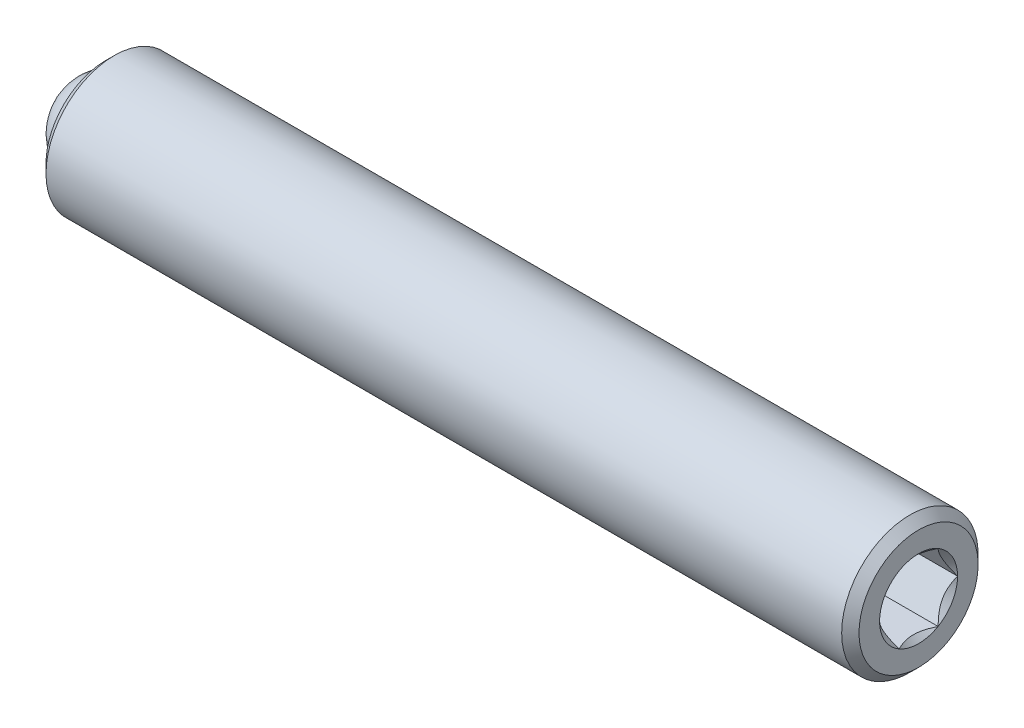
ISO-10303-21;
HEADER;
FILE_DESCRIPTION(('STEP AP214'),'2;1');
FILE_NAME('part.step','',(''),(''),'','','');
FILE_SCHEMA(('AUTOMOTIVE_DESIGN { 1 0 10303 214 1 1 1 1 }'));
ENDSEC;
DATA;
#1=APPLICATION_CONTEXT('core data for automotive mechanical design processes');
#2=APPLICATION_PROTOCOL_DEFINITION('international standard','automotive_design',2000,#1);
#3=PRODUCT_CONTEXT('',#1,'mechanical');
#4=PRODUCT('Part','Part','',(#3));
#5=PRODUCT_RELATED_PRODUCT_CATEGORY('part','',(#4));
#6=PRODUCT_DEFINITION_FORMATION('','',#4);
#7=PRODUCT_DEFINITION_CONTEXT('part definition',#1,'design');
#8=PRODUCT_DEFINITION('design','',#6,#7);
#9=PRODUCT_DEFINITION_SHAPE('','',#8);
#10=(LENGTH_UNIT() NAMED_UNIT(*) SI_UNIT(.MILLI.,.METRE.));
#11=(NAMED_UNIT(*) PLANE_ANGLE_UNIT() SI_UNIT($,.RADIAN.));
#12=(NAMED_UNIT(*) SI_UNIT($,.STERADIAN.) SOLID_ANGLE_UNIT());
#13=UNCERTAINTY_MEASURE_WITH_UNIT(LENGTH_MEASURE(1.E-05),#10,'distance_accuracy_value','');
#14=(GEOMETRIC_REPRESENTATION_CONTEXT(3) GLOBAL_UNCERTAINTY_ASSIGNED_CONTEXT((#13)) GLOBAL_UNIT_ASSIGNED_CONTEXT((#10,
#11,#12)) REPRESENTATION_CONTEXT('',''));
#15=CARTESIAN_POINT('',(0.,0.,0.));
#16=DIRECTION('',(0.,0.,1.));
#17=DIRECTION('',(1.,0.,0.));
#18=AXIS2_PLACEMENT_3D('',#15,#16,#17);
#19=CARTESIAN_POINT('',(-25.0609539380308,-2.1857766167841,19.3587570761906));
#20=DIRECTION('',(1.,0.,0.));
#21=DIRECTION('',(0.,0.,-1.));
#22=AXIS2_PLACEMENT_3D('',#19,#20,#21);
#23=PLANE('',#22);
#24=CARTESIAN_POINT('',(-25.0609539380308,-2.1857766167841,19.3587570761906));
#25=DIRECTION('',(1.,0.,0.));
#26=DIRECTION('',(0.,0.,-1.));
#27=AXIS2_PLACEMENT_3D('',#24,#25,#26);
#28=CIRCLE('',#27,0.99694999999999);
#29=CARTESIAN_POINT('',(-25.0609539380308,-1.5931847524018,18.5570437952928));
#30=VERTEX_POINT('',#29);
#31=CARTESIAN_POINT('',(-25.0609539380308,-1.1951766167841,19.2464141080085));
#32=VERTEX_POINT('',#31);
#33=EDGE_CURVE('P0_E11',#30,#32,#28,.T.);
#34=ORIENTED_EDGE('',*,*,#33,.F.);
#35=DIRECTION('',(0.,0.866025403784439,0.5));
#36=VECTOR('',#35,1.);
#37=CARTESIAN_POINT('',(-25.0609539380308,-2.1857766167841,18.2149107228721));
#38=LINE('',#37,#36);
#39=CARTESIAN_POINT('',(-25.0609539380308,-1.1951766167841,18.7868338995314));
#40=VERTEX_POINT('',#39);
#41=EDGE_CURVE('P0_E280',#30,#40,#38,.T.);
#42=ORIENTED_EDGE('',*,*,#41,.T.);
#43=DIRECTION('',(0.,0.,1.));
#44=VECTOR('',#43,1.);
#45=CARTESIAN_POINT('',(-25.0609539380308,-1.1951766167841,18.7868338995314));
#46=LINE('',#45,#44);
#47=EDGE_CURVE('P0_E233',#40,#32,#46,.T.);
#48=ORIENTED_EDGE('',*,*,#47,.T.);
#49=EDGE_LOOP('',(#34,#42,#48));
#50=FACE_BOUND('',#49,.T.);
#51=ADVANCED_FACE('P0_F17',(#50),#23,.T.);
#52=CARTESIAN_POINT('',(-25.0609539380308,-1.1951766167841,19.4711000443728));
#53=VERTEX_POINT('',#52);
#54=CARTESIAN_POINT('',(-25.0609539380308,-1.5931847524018,20.1604703570884));
#55=VERTEX_POINT('',#54);
#56=EDGE_CURVE('P0_E26',#53,#55,#28,.T.);
#57=ORIENTED_EDGE('',*,*,#56,.F.);
#58=CARTESIAN_POINT('',(-25.0609539380308,-1.1951766167841,19.9306802528499));
#59=VERTEX_POINT('',#58);
#60=EDGE_CURVE('P0_E275',#53,#59,#46,.T.);
#61=ORIENTED_EDGE('',*,*,#60,.T.);
#62=DIRECTION('',(0.,-0.866025403784439,0.5));
#63=VECTOR('',#62,1.);
#64=CARTESIAN_POINT('',(-25.0609539380308,-1.1951766167841,19.9306802528499));
#65=LINE('',#64,#63);
#66=EDGE_CURVE('P0_E296',#59,#55,#65,.T.);
#67=ORIENTED_EDGE('',*,*,#66,.T.);
#68=EDGE_LOOP('',(#57,#61,#67));
#69=FACE_BOUND('',#68,.T.);
#70=ADVANCED_FACE('P0_F332',(#69),#23,.T.);
#71=CARTESIAN_POINT('',(-25.0609539380308,-1.7877684811664,20.2728133252706));
#72=VERTEX_POINT('',#71);
#73=CARTESIAN_POINT('',(-25.0609539380308,-2.58378475240179,20.2728133252706));
#74=VERTEX_POINT('',#73);
#75=EDGE_CURVE('P0_E392',#72,#74,#28,.T.);
#76=ORIENTED_EDGE('',*,*,#75,.F.);
#77=CARTESIAN_POINT('',(-25.0609539380308,-2.1857766167841,20.5026034295091));
#78=VERTEX_POINT('',#77);
#79=EDGE_CURVE('P0_E250',#72,#78,#65,.T.);
#80=ORIENTED_EDGE('',*,*,#79,.T.);
#81=DIRECTION('',(0.,-0.866025403784439,-0.5));
#82=VECTOR('',#81,1.);
#83=CARTESIAN_POINT('',(-25.0609539380308,-2.1857766167841,20.5026034295091));
#84=LINE('',#83,#82);
#85=EDGE_CURVE('P0_E291',#78,#74,#84,.T.);
#86=ORIENTED_EDGE('',*,*,#85,.T.);
#87=EDGE_LOOP('',(#76,#80,#86));
#88=FACE_BOUND('',#87,.T.);
#89=ADVANCED_FACE('P0_F337',(#88),#23,.T.);
#90=CARTESIAN_POINT('',(-25.0609539380308,-2.7783684811664,20.1604703570884));
#91=VERTEX_POINT('',#90);
#92=CARTESIAN_POINT('',(-25.0609539380308,-3.1763766167841,19.4711000443728));
#93=VERTEX_POINT('',#92);
#94=EDGE_CURVE('P0_E369',#91,#93,#28,.T.);
#95=ORIENTED_EDGE('',*,*,#94,.F.);
#96=CARTESIAN_POINT('',(-25.0609539380308,-3.1763766167841,19.9306802528499));
#97=VERTEX_POINT('',#96);
#98=EDGE_CURVE('P0_E295',#91,#97,#84,.T.);
#99=ORIENTED_EDGE('',*,*,#98,.T.);
#100=DIRECTION('',(0.,0.,-1.));
#101=VECTOR('',#100,1.);
#102=CARTESIAN_POINT('',(-25.0609539380308,-3.1763766167841,19.9306802528499));
#103=LINE('',#102,#101);
#104=EDGE_CURVE('P0_E286',#97,#93,#103,.T.);
#105=ORIENTED_EDGE('',*,*,#104,.T.);
#106=EDGE_LOOP('',(#95,#99,#105));
#107=FACE_BOUND('',#106,.T.);
#108=ADVANCED_FACE('P0_F352',(#107),#23,.T.);
#109=CARTESIAN_POINT('',(-25.0609539380308,-3.1763766167841,19.2464141080084));
#110=VERTEX_POINT('',#109);
#111=CARTESIAN_POINT('',(-25.0609539380308,-2.7783684811664,18.5570437952928));
#112=VERTEX_POINT('',#111);
#113=EDGE_CURVE('P0_E363',#110,#112,#28,.T.);
#114=ORIENTED_EDGE('',*,*,#113,.F.);
#115=CARTESIAN_POINT('',(-25.0609539380308,-3.1763766167841,18.7868338995314));
#116=VERTEX_POINT('',#115);
#117=EDGE_CURVE('P0_E290',#110,#116,#103,.T.);
#118=ORIENTED_EDGE('',*,*,#117,.T.);
#119=DIRECTION('',(0.,0.866025403784439,-0.5));
#120=VECTOR('',#119,1.);
#121=CARTESIAN_POINT('',(-25.0609539380308,-3.1763766167841,18.7868338995314));
#122=LINE('',#121,#120);
#123=EDGE_CURVE('P0_E281',#116,#112,#122,.T.);
#124=ORIENTED_EDGE('',*,*,#123,.T.);
#125=EDGE_LOOP('',(#114,#118,#124));
#126=FACE_BOUND('',#125,.T.);
#127=ADVANCED_FACE('P0_F343',(#126),#23,.T.);
#128=CARTESIAN_POINT('',(-45.8445539380308,-0.788776616784098,19.3587570761906));
#129=DIRECTION('',(1.,0.,0.));
#130=DIRECTION('',(0.,0.,-1.));
#131=AXIS2_PLACEMENT_3D('',#128,#129,#130);
#132=PLANE('',#131);
#133=CARTESIAN_POINT('',(-45.8445539380308,-2.1857766167841,19.3587570761906));
#134=DIRECTION('',(1.,0.,0.));
#135=DIRECTION('',(0.,0.,-1.));
#136=AXIS2_PLACEMENT_3D('',#133,#134,#135);
#137=CIRCLE('',#136,1.74599999999999);
#138=CARTESIAN_POINT('',(-45.8445539380308,-2.1857766167841,17.6127570761906));
#139=VERTEX_POINT('',#138);
#140=EDGE_CURVE('P0_E210',#139,#139,#137,.F.);
#141=ORIENTED_EDGE('',*,*,#140,.T.);
#142=EDGE_LOOP('',(#141));
#143=FACE_BOUND('',#142,.T.);
#144=CARTESIAN_POINT('',(-45.8445539380308,-2.1857766167841,19.3587570761906));
#145=DIRECTION('',(-1.,0.,0.));
#146=DIRECTION('',(0.,0.,1.));
#147=AXIS2_PLACEMENT_3D('',#144,#145,#146);
#148=CIRCLE('',#147,1.397);
#149=CARTESIAN_POINT('',(-45.8445539380308,-2.1857766167841,20.7557570761906));
#150=VERTEX_POINT('',#149);
#151=EDGE_CURVE('P0_E222',#150,#150,#148,.T.);
#152=ORIENTED_EDGE('',*,*,#151,.F.);
#153=EDGE_LOOP('',(#152));
#154=FACE_BOUND('',#153,.T.);
#155=ADVANCED_FACE('P0_F351',(#143,#154),#132,.F.);
#156=CARTESIAN_POINT('',(-43.659460411547,-2.1857766167841,19.3587570761906));
#157=DIRECTION('',(-1.,0.,0.));
#158=DIRECTION('',(0.,0.,1.));
#159=AXIS2_PLACEMENT_3D('',#156,#157,#158);
#160=CYLINDRICAL_SURFACE('',#159,1.397);
#161=CARTESIAN_POINT('',(-45.056460411547,-2.1857766167841,19.3587570761906));
#162=DIRECTION('',(-1.,0.,0.));
#163=DIRECTION('',(0.,0.,1.));
#164=AXIS2_PLACEMENT_3D('',#161,#162,#163);
#165=CIRCLE('',#164,1.397);
#166=CARTESIAN_POINT('',(-45.056460411547,-2.1857766167841,20.7557570761906));
#167=VERTEX_POINT('',#166);
#168=EDGE_CURVE('P0_E225',#167,#167,#165,.T.);
#169=ORIENTED_EDGE('',*,*,#168,.F.);
#170=EDGE_LOOP('',(#169));
#171=FACE_BOUND('',#170,.T.);
#172=ORIENTED_EDGE('',*,*,#151,.T.);
#173=EDGE_LOOP('',(#172));
#174=FACE_BOUND('',#173,.T.);
#175=ADVANCED_FACE('P0_F358',(#171,#174),#160,.F.);
#176=CARTESIAN_POINT('',(-45.056460411547,-2.1857766167841,19.3587570761906));
#177=DIRECTION('',(-1.,0.,0.));
#178=DIRECTION('',(0.,0.,1.));
#179=AXIS2_PLACEMENT_3D('',#176,#177,#178);
#180=CONICAL_SURFACE('',#179,1.397,0.785398163397451);
#181=CARTESIAN_POINT('',(-43.659460411547,-2.1857766167841,19.3587570761906));
#182=VERTEX_POINT('',#181);
#183=VERTEX_LOOP('',#182);
#184=FACE_BOUND('',#183,.T.);
#185=ORIENTED_EDGE('',*,*,#168,.T.);
#186=EDGE_LOOP('',(#185));
#187=FACE_BOUND('',#186,.T.);
#188=ADVANCED_FACE('P0_F591',(#184,#187),#180,.F.);
#189=CARTESIAN_POINT('',(-22.0129539380308,-2.1857766167841,19.3587570761906));
#190=DIRECTION('',(-1.,0.,0.));
#191=DIRECTION('',(0.,0.,1.));
#192=AXIS2_PLACEMENT_3D('',#189,#190,#191);
#193=PLANE('',#192);
#194=DIRECTION('',(0.,-0.866025403784439,0.5));
#195=VECTOR('',#194,1.);
#196=CARTESIAN_POINT('',(-22.0129539380308,-1.1951766167841,19.9306802528499));
#197=LINE('',#196,#195);
#198=CARTESIAN_POINT('',(-22.0129539380308,-2.18431068983532,20.5017570761906));
#199=VERTEX_POINT('',#198);
#200=CARTESIAN_POINT('',(-22.0129539380308,-2.1857766167841,20.5026034295091));
#201=VERTEX_POINT('',#200);
#202=EDGE_CURVE('P0_E271',#199,#201,#197,.T.);
#203=ORIENTED_EDGE('',*,*,#202,.F.);
#204=CARTESIAN_POINT('',(-22.0129539380308,-2.1857766167841,19.3587570761906));
#205=DIRECTION('',(1.,0.,0.));
#206=DIRECTION('',(0.,1.,0.));
#207=AXIS2_PLACEMENT_3D('',#204,#205,#206);
#208=CIRCLE('',#207,1.143);
#209=CARTESIAN_POINT('',(-22.0129539380308,-1.19664417556542,19.9315275483073));
#210=VERTEX_POINT('',#209);
#211=EDGE_CURVE('P0_E40',#210,#199,#208,.T.);
#212=ORIENTED_EDGE('',*,*,#211,.F.);
#213=CARTESIAN_POINT('',(-22.0129539380308,-1.1951766167841,19.9306802528499));
#214=VERTEX_POINT('',#213);
#215=EDGE_CURVE('P0_E268',#214,#210,#197,.T.);
#216=ORIENTED_EDGE('',*,*,#215,.F.);
#217=DIRECTION('',(0.,0.,1.));
#218=VECTOR('',#217,1.);
#219=CARTESIAN_POINT('',(-22.0129539380308,-1.1951766167841,18.7868338995314));
#220=LINE('',#219,#218);
#221=CARTESIAN_POINT('',(-22.0129539380308,-1.1951766167841,19.928985661935));
#222=VERTEX_POINT('',#221);
#223=EDGE_CURVE('P0_E251',#222,#214,#220,.T.);
#224=ORIENTED_EDGE('',*,*,#223,.F.);
#225=CARTESIAN_POINT('',(-22.0129539380308,-1.1951766167841,18.7885284904463));
#226=VERTEX_POINT('',#225);
#227=EDGE_CURVE('P0_E157',#226,#222,#208,.T.);
#228=ORIENTED_EDGE('',*,*,#227,.F.);
#229=CARTESIAN_POINT('',(-22.0129539380308,-1.1951766167841,18.7868338995314));
#230=VERTEX_POINT('',#229);
#231=EDGE_CURVE('P0_E247',#230,#226,#220,.T.);
#232=ORIENTED_EDGE('',*,*,#231,.F.);
#233=DIRECTION('',(0.,0.866025403784439,0.5));
#234=VECTOR('',#233,1.);
#235=CARTESIAN_POINT('',(-22.0129539380308,-2.1857766167841,18.2149107228721));
#236=LINE('',#235,#234);
#237=CARTESIAN_POINT('',(-22.0129539380308,-1.19664417556542,18.7859866040739));
#238=VERTEX_POINT('',#237);
#239=EDGE_CURVE('P0_E255',#238,#230,#236,.T.);
#240=ORIENTED_EDGE('',*,*,#239,.F.);
#241=CARTESIAN_POINT('',(-22.0129539380308,-2.18430905800278,18.2157580183296));
#242=VERTEX_POINT('',#241);
#243=EDGE_CURVE('P0_E160',#242,#238,#208,.T.);
#244=ORIENTED_EDGE('',*,*,#243,.F.);
#245=CARTESIAN_POINT('',(-22.0129539380308,-2.1857766167841,18.2149107228721));
#246=VERTEX_POINT('',#245);
#247=EDGE_CURVE('P0_E252',#246,#242,#236,.T.);
#248=ORIENTED_EDGE('',*,*,#247,.F.);
#249=DIRECTION('',(0.,0.866025403784439,-0.5));
#250=VECTOR('',#249,1.);
#251=CARTESIAN_POINT('',(-22.0129539380308,-3.1763766167841,18.7868338995314));
#252=LINE('',#251,#250);
#253=CARTESIAN_POINT('',(-22.0129539380308,-2.18724254373287,18.2157570761906));
#254=VERTEX_POINT('',#253);
#255=EDGE_CURVE('P0_E259',#254,#246,#252,.T.);
#256=ORIENTED_EDGE('',*,*,#255,.F.);
#257=CARTESIAN_POINT('',(-22.0129539380308,-3.17490905800278,18.7859866040739));
#258=VERTEX_POINT('',#257);
#259=EDGE_CURVE('P0_E433',#258,#254,#208,.T.);
#260=ORIENTED_EDGE('',*,*,#259,.F.);
#261=CARTESIAN_POINT('',(-22.0129539380308,-3.1763766167841,18.7868338995314));
#262=VERTEX_POINT('',#261);
#263=EDGE_CURVE('P0_E256',#262,#258,#252,.T.);
#264=ORIENTED_EDGE('',*,*,#263,.F.);
#265=DIRECTION('',(0.,0.,-1.));
#266=VECTOR('',#265,1.);
#267=CARTESIAN_POINT('',(-22.0129539380308,-3.1763766167841,19.9306802528499));
#268=LINE('',#267,#266);
#269=CARTESIAN_POINT('',(-22.0129539380308,-3.1763766167841,18.7885284904463));
#270=VERTEX_POINT('',#269);
#271=EDGE_CURVE('P0_E263',#270,#262,#268,.T.);
#272=ORIENTED_EDGE('',*,*,#271,.F.);
#273=CARTESIAN_POINT('',(-22.0129539380308,-3.1763766167841,19.928985661935));
#274=VERTEX_POINT('',#273);
#275=EDGE_CURVE('P0_E429',#274,#270,#208,.T.);
#276=ORIENTED_EDGE('',*,*,#275,.F.);
#277=CARTESIAN_POINT('',(-22.0129539380308,-3.1763766167841,19.9306802528499));
#278=VERTEX_POINT('',#277);
#279=EDGE_CURVE('P0_E260',#278,#274,#268,.T.);
#280=ORIENTED_EDGE('',*,*,#279,.F.);
#281=DIRECTION('',(0.,-0.866025403784439,-0.5));
#282=VECTOR('',#281,1.);
#283=CARTESIAN_POINT('',(-22.0129539380308,-2.1857766167841,20.5026034295091));
#284=LINE('',#283,#282);
#285=CARTESIAN_POINT('',(-22.0129539380308,-3.17490905800278,19.9315275483073));
#286=VERTEX_POINT('',#285);
#287=EDGE_CURVE('P0_E267',#286,#278,#284,.T.);
#288=ORIENTED_EDGE('',*,*,#287,.F.);
#289=CARTESIAN_POINT('',(-22.0129539380308,-2.18724417556542,20.5017561340517));
#290=VERTEX_POINT('',#289);
#291=EDGE_CURVE('P0_E432',#290,#286,#208,.T.);
#292=ORIENTED_EDGE('',*,*,#291,.F.);
#293=EDGE_CURVE('P0_E264',#201,#290,#284,.T.);
#294=ORIENTED_EDGE('',*,*,#293,.F.);
#295=EDGE_LOOP('',(#203,#212,#216,#224,#228,#232,#240,#244,#248,#256,#260,#264,#272,#276,#280,
#288,#292,#294));
#296=FACE_BOUND('',#295,.T.);
#297=CARTESIAN_POINT('',(-22.0129539380308,-2.1857766167841,19.3587570761906));
#298=DIRECTION('',(-1.,0.,0.));
#299=DIRECTION('',(0.,0.,1.));
#300=AXIS2_PLACEMENT_3D('',#297,#298,#299);
#301=CIRCLE('',#300,1.74599999999999);
#302=CARTESIAN_POINT('',(-22.0129539380308,-2.1857766167841,21.1047570761906));
#303=VERTEX_POINT('',#302);
#304=EDGE_CURVE('P0_E213',#303,#303,#301,.F.);
#305=ORIENTED_EDGE('',*,*,#304,.T.);
#306=EDGE_LOOP('',(#305));
#307=FACE_BOUND('',#306,.T.);
#308=ADVANCED_FACE('P0_F425',(#296,#307),#193,.F.);
#309=CARTESIAN_POINT('',(-43.659460411547,-2.1857766167841,19.3587570761906));
#310=DIRECTION('',(-1.,0.,0.));
#311=DIRECTION('',(0.,0.,1.));
#312=AXIS2_PLACEMENT_3D('',#309,#310,#311);
#313=CYLINDRICAL_SURFACE('',#312,2.);
#314=CARTESIAN_POINT('',(-22.2669539380308,-2.1857766167841,19.3587570761906));
#315=DIRECTION('',(-1.,0.,0.));
#316=DIRECTION('',(0.,0.,1.));
#317=AXIS2_PLACEMENT_3D('',#314,#315,#316);
#318=CIRCLE('',#317,2.);
#319=CARTESIAN_POINT('',(-22.2669539380308,-2.1857766167841,21.3587570761906));
#320=VERTEX_POINT('',#319);
#321=EDGE_CURVE('P0_E216',#320,#320,#318,.T.);
#322=ORIENTED_EDGE('',*,*,#321,.T.);
#323=EDGE_LOOP('',(#322));
#324=FACE_BOUND('',#323,.T.);
#325=CARTESIAN_POINT('',(-45.5905539380308,-2.1857766167841,19.3587570761906));
#326=DIRECTION('',(1.,0.,0.));
#327=DIRECTION('',(0.,0.,-1.));
#328=AXIS2_PLACEMENT_3D('',#325,#326,#327);
#329=CIRCLE('',#328,2.);
#330=CARTESIAN_POINT('',(-45.5905539380308,-2.1857766167841,17.3587570761906));
#331=VERTEX_POINT('',#330);
#332=EDGE_CURVE('P0_E219',#331,#331,#329,.T.);
#333=ORIENTED_EDGE('',*,*,#332,.T.);
#334=EDGE_LOOP('',(#333));
#335=FACE_BOUND('',#334,.T.);
#336=ADVANCED_FACE('P0_F572',(#324,#335),#313,.T.);
#337=CARTESIAN_POINT('',(-22.2669539380308,-2.1857766167841,19.3587570761906));
#338=DIRECTION('',(-1.,0.,0.));
#339=DIRECTION('',(0.,0.,1.));
#340=AXIS2_PLACEMENT_3D('',#337,#338,#339);
#341=CONICAL_SURFACE('',#340,2.,0.785398163397453);
#342=ORIENTED_EDGE('',*,*,#304,.F.);
#343=EDGE_LOOP('',(#342));
#344=FACE_BOUND('',#343,.T.);
#345=ORIENTED_EDGE('',*,*,#321,.F.);
#346=EDGE_LOOP('',(#345));
#347=FACE_BOUND('',#346,.T.);
#348=ADVANCED_FACE('P0_F563',(#344,#347),#341,.T.);
#349=CARTESIAN_POINT('',(-45.8445539380308,-2.1857766167841,19.3587570761906));
#350=DIRECTION('',(1.,0.,0.));
#351=DIRECTION('',(0.,0.,-1.));
#352=AXIS2_PLACEMENT_3D('',#349,#350,#351);
#353=CONICAL_SURFACE('',#352,1.74599999999999,0.785398163397447);
#354=ORIENTED_EDGE('',*,*,#332,.F.);
#355=EDGE_LOOP('',(#354));
#356=FACE_BOUND('',#355,.T.);
#357=ORIENTED_EDGE('',*,*,#140,.F.);
#358=EDGE_LOOP('',(#357));
#359=FACE_BOUND('',#358,.T.);
#360=ADVANCED_FACE('P0_F19',(#356,#359),#353,.T.);
#361=CARTESIAN_POINT('',(-25.0609539380308,-1.1951766167841,19.9306802528499));
#362=DIRECTION('',(0.,0.5,0.866025403784439));
#363=DIRECTION('',(0.,-0.866025403784439,0.5));
#364=AXIS2_PLACEMENT_3D('',#361,#362,#363);
#365=PLANE('',#364);
#366=ORIENTED_EDGE('',*,*,#215,.T.);
#367=CARTESIAN_POINT('',(-22.0127539380306,-1.19629708462967,19.9313271552621));
#368=CARTESIAN_POINT('',(-22.0323203966513,-1.23027713683179,19.9509455475481));
#369=CARTESIAN_POINT('',(-22.050734551924,-1.26482458320621,19.9708915250122));
#370=CARTESIAN_POINT('',(-22.0844446571083,-1.33526642538763,20.0115611415578));
#371=CARTESIAN_POINT('',(-22.099721950327,-1.37116745758587,20.0322886121617));
#372=CARTESIAN_POINT('',(-22.1258887915356,-1.44355953242849,20.0740841960592));
#373=CARTESIAN_POINT('',(-22.1368438216406,-1.48003230401243,20.0951417605513));
#374=CARTESIAN_POINT('',(-22.1537198985939,-1.55377672378025,20.1377181211555));
#375=CARTESIAN_POINT('',(-22.1596534608479,-1.59104614703134,20.1592356327021));
#376=CARTESIAN_POINT('',(-22.165007326587,-1.65534085443795,20.1963561993307));
#377=CARTESIAN_POINT('',(-22.1657947467285,-1.68228352692575,20.2119115585443));
#378=CARTESIAN_POINT('',(-22.1644413410196,-1.73611604660882,20.2429917782744));
#379=CARTESIAN_POINT('',(-22.1622998637595,-1.76300588072026,20.2585166312371));
#380=CARTESIAN_POINT('',(-22.1516239297961,-1.84329004327281,20.3048687140985));
#381=CARTESIAN_POINT('',(-22.1388368167575,-1.89628409647321,20.3354648449792));
#382=CARTESIAN_POINT('',(-22.1080756453399,-1.98903319238966,20.3890135604737));
#383=CARTESIAN_POINT('',(-22.0917517057209,-2.02923399266128,20.4122235033321));
#384=CARTESIAN_POINT('',(-22.0549984488649,-2.10806972391492,20.4577393339932));
#385=CARTESIAN_POINT('',(-22.0345825312321,-2.14670928360318,20.4800478941806));
#386=CARTESIAN_POINT('',(-22.0127539380308,-2.18465614893815,20.5019565270966));
#387=B_SPLINE_CURVE_WITH_KNOTS('',3,(#367,#368,#369,#370,#371,#372,#373,#374,#375,#376,#377,
#378,#379,#380,#381,#382,#383,#384,#385,#386),.UNSPECIFIED.,.F.,.F.,(4,2,2,2,2,2,2,2,2,4),(0.,
0.1316251276196,0.264011770716206,0.394307736662359,0.524277991049733,0.617504646941291,
0.710752040542361,0.897297861024574,1.04472299547961,1.19167303462289),.UNSPECIFIED.);
#388=EDGE_CURVE('P0_E300',#210,#199,#387,.T.);
#389=ORIENTED_EDGE('',*,*,#388,.T.);
#390=ORIENTED_EDGE('',*,*,#202,.T.);
#391=DIRECTION('',(1.,0.,0.));
#392=VECTOR('',#391,1.);
#393=CARTESIAN_POINT('',(-25.0609539380308,-2.1857766167841,20.5026034295091));
#394=LINE('',#393,#392);
#395=EDGE_CURVE('P0_E229',#78,#201,#394,.T.);
#396=ORIENTED_EDGE('',*,*,#395,.F.);
#397=ORIENTED_EDGE('',*,*,#79,.F.);
#398=EDGE_CURVE('P0_E299',#55,#72,#65,.T.);
#399=ORIENTED_EDGE('',*,*,#398,.F.);
#400=ORIENTED_EDGE('',*,*,#66,.F.);
#401=DIRECTION('',(1.,0.,0.));
#402=VECTOR('',#401,1.);
#403=CARTESIAN_POINT('',(-25.0609539380308,-1.1951766167841,19.9306802528499));
#404=LINE('',#403,#402);
#405=EDGE_CURVE('P0_E228',#59,#214,#404,.T.);
#406=ORIENTED_EDGE('',*,*,#405,.T.);
#407=EDGE_LOOP('',(#366,#389,#390,#396,#397,#399,#400,#406));
#408=FACE_BOUND('',#407,.T.);
#409=ADVANCED_FACE('P0_F200',(#408),#365,.F.);
#410=CARTESIAN_POINT('',(-25.0609539380308,-1.1951766167841,18.7868338995314));
#411=DIRECTION('',(0.,1.,0.));
#412=DIRECTION('',(0.,0.,1.));
#413=AXIS2_PLACEMENT_3D('',#410,#411,#412);
#414=PLANE('',#413);
#415=ORIENTED_EDGE('',*,*,#231,.T.);
#416=CARTESIAN_POINT('',(-21.6456437212551,-1.1951766167841,18.2186919066072));
#417=CARTESIAN_POINT('',(-21.6665971803185,-1.1951766167841,18.2464543932723));
#418=CARTESIAN_POINT('',(-21.6873450172186,-1.1951766167841,18.2743716351102));
#419=CARTESIAN_POINT('',(-21.7283445269502,-1.1951766167841,18.3305783910264));
#420=CARTESIAN_POINT('',(-21.7485960747308,-1.1951766167841,18.358867996225));
#421=CARTESIAN_POINT('',(-21.8087678776801,-1.1951766167841,18.4448036925445));
#422=CARTESIAN_POINT('',(-21.8477825630218,-1.1951766167841,18.503094552172));
#423=CARTESIAN_POINT('',(-21.9243677119673,-1.1951766167841,18.6253244547819));
#424=CARTESIAN_POINT('',(-21.9617290347737,-1.1951766167841,18.6893960468096));
#425=CARTESIAN_POINT('',(-22.0300671318701,-1.1951766167841,18.8207387265946));
#426=CARTESIAN_POINT('',(-22.0610654287238,-1.1951766167841,18.8879980487983));
#427=CARTESIAN_POINT('',(-22.0989887951195,-1.1951766167841,18.988960474439));
#428=CARTESIAN_POINT('',(-22.1098740484261,-1.1951766167841,19.0211700554222));
#429=CARTESIAN_POINT('',(-22.1290585889083,-1.1951766167841,19.0863663095114));
#430=CARTESIAN_POINT('',(-22.137357697771,-1.1951766167841,19.1193530360324));
#431=CARTESIAN_POINT('',(-22.1507997441353,-1.1951766167841,19.1853502866765));
#432=CARTESIAN_POINT('',(-22.1559971777705,-1.1951766167841,19.2183495355872));
#433=CARTESIAN_POINT('',(-22.1631378151264,-1.1951766167841,19.2847110702303));
#434=CARTESIAN_POINT('',(-22.165080521211,-1.1951766167841,19.3180734106935));
#435=CARTESIAN_POINT('',(-22.1655645205581,-1.1951766167841,19.3836166067033));
#436=CARTESIAN_POINT('',(-22.1642261276975,-1.1951766167841,19.4157966151519));
#437=CARTESIAN_POINT('',(-22.1584880077532,-1.1951766167841,19.4798699930781));
#438=CARTESIAN_POINT('',(-22.1540889840993,-1.1951766167841,19.5117634267139));
#439=CARTESIAN_POINT('',(-22.1423950597889,-1.1951766167841,19.5755886979688));
#440=CARTESIAN_POINT('',(-22.1350504427217,-1.1951766167841,19.6075112879808));
#441=CARTESIAN_POINT('',(-22.1178555417028,-1.1951766167841,19.6706590428319));
#442=CARTESIAN_POINT('',(-22.1080054681313,-1.1951766167841,19.7018842659889));
#443=CARTESIAN_POINT('',(-22.0732804419676,-1.1951766167841,19.8002201044918));
#444=CARTESIAN_POINT('',(-22.0444496083024,-1.1951766167841,19.8659303847116));
#445=CARTESIAN_POINT('',(-21.9803485297404,-1.1951766167841,19.9942637799689));
#446=CARTESIAN_POINT('',(-21.9450551445965,-1.1951766167841,20.0568747396915));
#447=CARTESIAN_POINT('',(-21.872242612124,-1.1951766167841,20.1765329069357));
#448=CARTESIAN_POINT('',(-21.8349212556563,-1.1951766167841,20.2337019790826));
#449=CARTESIAN_POINT('',(-21.7772266519361,-1.1951766167841,20.3179291144673));
#450=CARTESIAN_POINT('',(-21.7577917564146,-1.1951766167841,20.3456412976581));
#451=CARTESIAN_POINT('',(-21.7184080438067,-1.1951766167841,20.4006870041668));
#452=CARTESIAN_POINT('',(-21.6984593687092,-1.1951766167841,20.4280206289596));
#453=CARTESIAN_POINT('',(-21.678297665075,-1.1951766167841,20.4551966326669));
#454=B_SPLINE_CURVE_WITH_KNOTS('',3,(#416,#417,#418,#419,#420,#421,#422,#423,#424,#425,#426,
#427,#428,#429,#430,#431,#432,#433,#434,#435,#436,#437,#438,#439,#440,#441,#442,#443,#444,#445,
#446,#447,#448,#449,#450,#451,#452,#453),.UNSPECIFIED.,.F.,.F.,(4,2,2,2,2,2,2,2,2,2,2,2,2,2,2,2,
2,2,4),(0.,0.104344019556665,0.208714065995308,0.41904723860194,0.641371595426507,
0.862931089855693,0.964842435960918,1.06676080722522,1.16683130424734,1.26691710029625,
1.36338812254199,1.45983698002154,1.55798726512869,1.65612931138883,1.87076833826788,
2.08619150382141,2.29090841446405,2.39244822901591,2.49396027677513),.UNSPECIFIED.);
#455=EDGE_CURVE('P0_E306',#226,#222,#454,.T.);
#456=ORIENTED_EDGE('',*,*,#455,.T.);
#457=ORIENTED_EDGE('',*,*,#223,.T.);
#458=ORIENTED_EDGE('',*,*,#405,.F.);
#459=ORIENTED_EDGE('',*,*,#60,.F.);
#460=EDGE_CURVE('P0_E274',#32,#53,#46,.T.);
#461=ORIENTED_EDGE('',*,*,#460,.F.);
#462=ORIENTED_EDGE('',*,*,#47,.F.);
#463=DIRECTION('',(1.,0.,0.));
#464=VECTOR('',#463,1.);
#465=CARTESIAN_POINT('',(-25.0609539380308,-1.1951766167841,18.7868338995314));
#466=LINE('',#465,#464);
#467=EDGE_CURVE('P0_E242',#40,#230,#466,.T.);
#468=ORIENTED_EDGE('',*,*,#467,.T.);
#469=EDGE_LOOP('',(#415,#456,#457,#458,#459,#461,#462,#468));
#470=FACE_BOUND('',#469,.T.);
#471=ADVANCED_FACE('P0_F318',(#470),#414,.F.);
#472=CARTESIAN_POINT('',(-25.0609539380308,-2.1857766167841,18.2149107228721));
#473=DIRECTION('',(0.,0.5,-0.866025403784439));
#474=DIRECTION('',(0.,0.866025403784439,0.5));
#475=AXIS2_PLACEMENT_3D('',#472,#473,#474);
#476=PLANE('',#475);
#477=ORIENTED_EDGE('',*,*,#247,.T.);
#478=CARTESIAN_POINT('',(-22.0127539380308,-2.18465614893816,18.2155576252846));
#479=CARTESIAN_POINT('',(-22.0323203966515,-2.15067609673606,18.2351760175706));
#480=CARTESIAN_POINT('',(-22.0507345519242,-2.11612865036166,18.2551219950346));
#481=CARTESIAN_POINT('',(-22.0844446571085,-2.04568680818029,18.2957916115803));
#482=CARTESIAN_POINT('',(-22.0997219503271,-2.00978577598207,18.3165190821841));
#483=CARTESIAN_POINT('',(-22.1258887915356,-1.93739370113951,18.3583146660816));
#484=CARTESIAN_POINT('',(-22.1368438216406,-1.90092092955559,18.3793722305737));
#485=CARTESIAN_POINT('',(-22.153719898594,-1.82717650978782,18.4219485911779));
#486=CARTESIAN_POINT('',(-22.1596534608479,-1.78990708653676,18.4434661027244));
#487=CARTESIAN_POINT('',(-22.165007326587,-1.72561237913018,18.4805866693531));
#488=CARTESIAN_POINT('',(-22.1657947467285,-1.69866970664238,18.4961420285666));
#489=CARTESIAN_POINT('',(-22.1644413410196,-1.64483718695932,18.5272222482967));
#490=CARTESIAN_POINT('',(-22.1622998637595,-1.61794735284788,18.5427471012595));
#491=CARTESIAN_POINT('',(-22.1516239297961,-1.53766319029533,18.5890991841208));
#492=CARTESIAN_POINT('',(-22.1388368167575,-1.48466913709493,18.6196953150015));
#493=CARTESIAN_POINT('',(-22.1080756453399,-1.39192004117843,18.673244030496));
#494=CARTESIAN_POINT('',(-22.0917517057209,-1.35171924090675,18.6964539733545));
#495=CARTESIAN_POINT('',(-22.0549984488648,-1.27288350965301,18.7419698040156));
#496=CARTESIAN_POINT('',(-22.034582531232,-1.23424394996469,18.764278364203));
#497=CARTESIAN_POINT('',(-22.0127539380306,-1.19629708462967,18.7861869971191));
#498=B_SPLINE_CURVE_WITH_KNOTS('',3,(#478,#479,#480,#481,#482,#483,#484,#485,#486,#487,#488,
#489,#490,#491,#492,#493,#494,#495,#496,#497),.UNSPECIFIED.,.F.,.F.,(4,2,2,2,2,2,2,2,2,4),(0.,
0.131625127619501,0.264011770716004,0.394307736662059,0.524277991049336,0.617504646940887,
0.710752040541952,0.89729786102416,1.04472299547941,1.19167303462289),.UNSPECIFIED.);
#499=EDGE_CURVE('P0_E313',#242,#238,#498,.T.);
#500=ORIENTED_EDGE('',*,*,#499,.T.);
#501=ORIENTED_EDGE('',*,*,#239,.T.);
#502=ORIENTED_EDGE('',*,*,#467,.F.);
#503=ORIENTED_EDGE('',*,*,#41,.F.);
#504=CARTESIAN_POINT('',(-25.0609539380308,-1.7877684811664,18.4447008271107));
#505=VERTEX_POINT('',#504);
#506=EDGE_CURVE('P0_E279',#505,#30,#38,.T.);
#507=ORIENTED_EDGE('',*,*,#506,.F.);
#508=CARTESIAN_POINT('',(-25.0609539380308,-2.1857766167841,18.2149107228721));
#509=VERTEX_POINT('',#508);
#510=EDGE_CURVE('P0_E276',#509,#505,#38,.T.);
#511=ORIENTED_EDGE('',*,*,#510,.F.);
#512=DIRECTION('',(1.,0.,0.));
#513=VECTOR('',#512,1.);
#514=CARTESIAN_POINT('',(-25.0609539380308,-2.1857766167841,18.2149107228721));
#515=LINE('',#514,#513);
#516=EDGE_CURVE('P0_E239',#509,#246,#515,.T.);
#517=ORIENTED_EDGE('',*,*,#516,.T.);
#518=EDGE_LOOP('',(#477,#500,#501,#502,#503,#507,#511,#517));
#519=FACE_BOUND('',#518,.T.);
#520=ADVANCED_FACE('P0_F321',(#519),#476,.F.);
#521=CARTESIAN_POINT('',(-25.0609539380308,-3.1763766167841,18.7868338995314));
#522=DIRECTION('',(0.,-0.5,-0.866025403784439));
#523=DIRECTION('',(0.,0.866025403784439,-0.5));
#524=AXIS2_PLACEMENT_3D('',#521,#522,#523);
#525=PLANE('',#524);
#526=ORIENTED_EDGE('',*,*,#263,.T.);
#527=CARTESIAN_POINT('',(-22.0127539380306,-3.17525614893852,18.7861869971191));
#528=CARTESIAN_POINT('',(-22.0323203966513,-3.14127609673641,18.7665686048331));
#529=CARTESIAN_POINT('',(-22.050734551924,-3.10672865036199,18.7466226273691));
#530=CARTESIAN_POINT('',(-22.0844446571083,-3.03628680818057,18.7059530108234));
#531=CARTESIAN_POINT('',(-22.099721950327,-3.00038577598233,18.6852255402196));
#532=CARTESIAN_POINT('',(-22.1258887915356,-2.92799370113971,18.643429956322));
#533=CARTESIAN_POINT('',(-22.1368438216406,-2.89152092955576,18.6223723918299));
#534=CARTESIAN_POINT('',(-22.1537198985939,-2.81777650978795,18.5797960312257));
#535=CARTESIAN_POINT('',(-22.1596534608479,-2.78050708653686,18.5582785196792));
#536=CARTESIAN_POINT('',(-22.165007326587,-2.71621237913025,18.5211579530505));
#537=CARTESIAN_POINT('',(-22.1657947467285,-2.68926970664245,18.505602593837));
#538=CARTESIAN_POINT('',(-22.1644413410196,-2.63543718695938,18.4745223741068));
#539=CARTESIAN_POINT('',(-22.1622998637595,-2.60854735284794,18.4589975211441));
#540=CARTESIAN_POINT('',(-22.1516239297961,-2.52826319029538,18.4126454382827));
#541=CARTESIAN_POINT('',(-22.1388368167575,-2.47526913709499,18.382049307402));
#542=CARTESIAN_POINT('',(-22.1080756453399,-2.38252004117854,18.3285005919075));
#543=CARTESIAN_POINT('',(-22.0917517057209,-2.34231924090692,18.3052906490491));
#544=CARTESIAN_POINT('',(-22.0549984488649,-2.26348350965328,18.259774818388));
#545=CARTESIAN_POINT('',(-22.0345825312321,-2.22484394996501,18.2374662582006));
#546=CARTESIAN_POINT('',(-22.0127539380308,-2.18689708463004,18.2155576252846));
#547=B_SPLINE_CURVE_WITH_KNOTS('',3,(#527,#528,#529,#530,#531,#532,#533,#534,#535,#536,#537,
#538,#539,#540,#541,#542,#543,#544,#545,#546),.UNSPECIFIED.,.F.,.F.,(4,2,2,2,2,2,2,2,2,4),(0.,
0.131625127619602,0.264011770716207,0.39430773666236,0.524277991049735,0.617504646941288,
0.71075204054236,0.897297861024575,1.04472299547962,1.1916730346229),.UNSPECIFIED.);
#548=EDGE_CURVE('P0_E175',#258,#254,#547,.T.);
#549=ORIENTED_EDGE('',*,*,#548,.T.);
#550=ORIENTED_EDGE('',*,*,#255,.T.);
#551=ORIENTED_EDGE('',*,*,#516,.F.);
#552=CARTESIAN_POINT('',(-25.0609539380308,-2.58378475240179,18.4447008271107));
#553=VERTEX_POINT('',#552);
#554=EDGE_CURVE('P0_E285',#553,#509,#122,.T.);
#555=ORIENTED_EDGE('',*,*,#554,.F.);
#556=EDGE_CURVE('P0_E284',#112,#553,#122,.T.);
#557=ORIENTED_EDGE('',*,*,#556,.F.);
#558=ORIENTED_EDGE('',*,*,#123,.F.);
#559=DIRECTION('',(1.,0.,0.));
#560=VECTOR('',#559,1.);
#561=CARTESIAN_POINT('',(-25.0609539380308,-3.1763766167841,18.7868338995314));
#562=LINE('',#561,#560);
#563=EDGE_CURVE('P0_E236',#116,#262,#562,.T.);
#564=ORIENTED_EDGE('',*,*,#563,.T.);
#565=EDGE_LOOP('',(#526,#549,#550,#551,#555,#557,#558,#564));
#566=FACE_BOUND('',#565,.T.);
#567=ADVANCED_FACE('P0_F191',(#566),#525,.F.);
#568=CARTESIAN_POINT('',(-25.0609539380308,-3.1763766167841,19.9306802528499));
#569=DIRECTION('',(0.,-1.,0.));
#570=DIRECTION('',(0.,0.,-1.));
#571=AXIS2_PLACEMENT_3D('',#568,#569,#570);
#572=PLANE('',#571);
#573=ORIENTED_EDGE('',*,*,#279,.T.);
#574=CARTESIAN_POINT('',(-21.6456437211253,-3.1763766167841,18.2186919064353));
#575=CARTESIAN_POINT('',(-21.6665971801936,-3.1763766167841,18.2464543931052));
#576=CARTESIAN_POINT('',(-21.6873450170988,-3.1763766167841,18.2743716349479));
#577=CARTESIAN_POINT('',(-21.7283445268403,-3.1763766167841,18.3305783908738));
#578=CARTESIAN_POINT('',(-21.7485960746259,-3.1763766167841,18.3588679960773));
#579=CARTESIAN_POINT('',(-21.8087678775902,-3.1763766167841,18.4448036924117));
#580=CARTESIAN_POINT('',(-21.8477825629418,-3.1763766167841,18.5030945520494));
#581=CARTESIAN_POINT('',(-21.9243677119078,-3.1763766167841,18.6253244546815));
#582=CARTESIAN_POINT('',(-21.9617290347247,-3.1763766167841,18.6893960467213));
#583=CARTESIAN_POINT('',(-22.0300671318404,-3.1763766167841,18.8207387265315));
#584=CARTESIAN_POINT('',(-22.061065428703,-3.1763766167841,18.8879980487482));
#585=CARTESIAN_POINT('',(-22.0989887951053,-3.1763766167841,18.9889604743988));
#586=CARTESIAN_POINT('',(-22.1098740484117,-3.1763766167841,19.0211700553779));
#587=CARTESIAN_POINT('',(-22.1290585888942,-3.1763766167841,19.0863663094587));
#588=CARTESIAN_POINT('',(-22.1373576977575,-3.1763766167841,19.1193530359755));
#589=CARTESIAN_POINT('',(-22.1507997441239,-3.1763766167841,19.1853502866112));
#590=CARTESIAN_POINT('',(-22.1559971777606,-3.1763766167841,19.2183495355177));
#591=CARTESIAN_POINT('',(-22.1631378151205,-3.1763766167841,19.2847110701528));
#592=CARTESIAN_POINT('',(-22.1650805212075,-3.1763766167841,19.318073410612));
#593=CARTESIAN_POINT('',(-22.1655645205602,-3.1763766167841,19.3836166066145));
#594=CARTESIAN_POINT('',(-22.1642261277027,-3.1763766167841,19.4157966150597));
#595=CARTESIAN_POINT('',(-22.1584880077651,-3.1763766167841,19.4798699929794));
#596=CARTESIAN_POINT('',(-22.1540889841147,-3.1763766167841,19.5117634266122));
#597=CARTESIAN_POINT('',(-22.1423950598119,-3.1763766167841,19.5755886978611));
#598=CARTESIAN_POINT('',(-22.1350504427486,-3.1763766167841,19.6075112878701));
#599=CARTESIAN_POINT('',(-22.1178555417376,-3.1763766167841,19.6706590427157));
#600=CARTESIAN_POINT('',(-22.1080054681702,-3.1763766167841,19.7018842658699));
#601=CARTESIAN_POINT('',(-22.0732804420255,-3.1763766167841,19.8002201043469));
#602=CARTESIAN_POINT('',(-22.0444496083778,-3.1763766167841,19.8659303845448));
#603=CARTESIAN_POINT('',(-21.9803485298527,-3.1763766167841,19.9942637797599));
#604=CARTESIAN_POINT('',(-21.9450551447282,-3.1763766167841,20.0568747394623));
#605=CARTESIAN_POINT('',(-21.8722426122929,-3.1763766167841,20.1765329066701));
#606=CARTESIAN_POINT('',(-21.8349212558429,-3.1763766167841,20.2337019788007));
#607=CARTESIAN_POINT('',(-21.7772266521489,-3.1763766167841,20.3179291141613));
#608=CARTESIAN_POINT('',(-21.7577917566361,-3.1763766167841,20.3456412973442));
#609=CARTESIAN_POINT('',(-21.7184080440456,-3.1763766167841,20.4006870038371));
#610=CARTESIAN_POINT('',(-21.6984593689568,-3.1763766167841,20.4280206286221));
#611=CARTESIAN_POINT('',(-21.6782976653312,-3.1763766167841,20.4551966323215));
#612=B_SPLINE_CURVE_WITH_KNOTS('',3,(#574,#575,#576,#577,#578,#579,#580,#581,#582,#583,#584,
#585,#586,#587,#588,#589,#590,#591,#592,#593,#594,#595,#596,#597,#598,#599,#600,#601,#602,#603,
#604,#605,#606,#607,#608,#609,#610,#611),.UNSPECIFIED.,.F.,.F.,(4,2,2,2,2,2,2,2,2,2,2,2,2,2,2,2,
2,2,4),(0.,0.104344019577248,0.208714066036483,0.419047238685063,0.64137159555667,
0.862931090032445,0.964842436125756,1.06676080737816,1.16683130438887,1.26691710042635,
1.36338812266163,1.45983698013069,1.55798726522656,1.65612931147543,1.87076833827348,
2.08619150374547,2.29090841431836,2.39244822883581,2.49396027656062),.UNSPECIFIED.);
#613=EDGE_CURVE('P0_E166',#274,#270,#612,.F.);
#614=ORIENTED_EDGE('',*,*,#613,.T.);
#615=ORIENTED_EDGE('',*,*,#271,.T.);
#616=ORIENTED_EDGE('',*,*,#563,.F.);
#617=ORIENTED_EDGE('',*,*,#117,.F.);
#618=EDGE_CURVE('P0_E289',#93,#110,#103,.T.);
#619=ORIENTED_EDGE('',*,*,#618,.F.);
#620=ORIENTED_EDGE('',*,*,#104,.F.);
#621=DIRECTION('',(1.,0.,0.));
#622=VECTOR('',#621,1.);
#623=CARTESIAN_POINT('',(-25.0609539380308,-3.1763766167841,19.9306802528499));
#624=LINE('',#623,#622);
#625=EDGE_CURVE('P0_E232',#97,#278,#624,.T.);
#626=ORIENTED_EDGE('',*,*,#625,.T.);
#627=EDGE_LOOP('',(#573,#614,#615,#616,#617,#619,#620,#626));
#628=FACE_BOUND('',#627,.T.);
#629=ADVANCED_FACE('P0_F186',(#628),#572,.F.);
#630=CARTESIAN_POINT('',(-25.0609539380308,-2.1857766167841,20.5026034295091));
#631=DIRECTION('',(0.,-0.5,0.866025403784439));
#632=DIRECTION('',(0.,-0.866025403784439,-0.5));
#633=AXIS2_PLACEMENT_3D('',#630,#631,#632);
#634=PLANE('',#633);
#635=ORIENTED_EDGE('',*,*,#293,.T.);
#636=CARTESIAN_POINT('',(-22.0127539380308,-2.18689708463004,20.5019565270966));
#637=CARTESIAN_POINT('',(-22.0323203966515,-2.22087713683213,20.4823381348107));
#638=CARTESIAN_POINT('',(-22.0507345519242,-2.25542458320654,20.4623921573466));
#639=CARTESIAN_POINT('',(-22.0844446571085,-2.32586642538791,20.421722540801));
#640=CARTESIAN_POINT('',(-22.0997219503271,-2.36176745758612,20.4009950701971));
#641=CARTESIAN_POINT('',(-22.1258887915356,-2.43415953242869,20.3591994862996));
#642=CARTESIAN_POINT('',(-22.1368438216406,-2.47063230401261,20.3381419218075));
#643=CARTESIAN_POINT('',(-22.153719898594,-2.54437672378037,20.2955655612034));
#644=CARTESIAN_POINT('',(-22.1596534608479,-2.58164614703143,20.2740480496568));
#645=CARTESIAN_POINT('',(-22.165007326587,-2.64594085443801,20.2369274830282));
#646=CARTESIAN_POINT('',(-22.1657947467285,-2.67288352692581,20.2213721238146));
#647=CARTESIAN_POINT('',(-22.1644413410196,-2.72671604660888,20.1902919040845));
#648=CARTESIAN_POINT('',(-22.1622998637595,-2.75360588072032,20.1747670511218));
#649=CARTESIAN_POINT('',(-22.1516239297961,-2.83389004327287,20.1284149682604));
#650=CARTESIAN_POINT('',(-22.1388368167575,-2.88688409647326,20.0978188373797));
#651=CARTESIAN_POINT('',(-22.1080756453399,-2.97963319238977,20.0442701218852));
#652=CARTESIAN_POINT('',(-22.0917517057209,-3.01983399266144,20.0210601790267));
#653=CARTESIAN_POINT('',(-22.0549984488648,-3.09866972391519,19.9755443483656));
#654=CARTESIAN_POINT('',(-22.034582531232,-3.1373092836035,19.9532357881782));
#655=CARTESIAN_POINT('',(-22.0127539380306,-3.17525614893852,19.9313271552621));
#656=B_SPLINE_CURVE_WITH_KNOTS('',3,(#636,#637,#638,#639,#640,#641,#642,#643,#644,#645,#646,
#647,#648,#649,#650,#651,#652,#653,#654,#655),.UNSPECIFIED.,.F.,.F.,(4,2,2,2,2,2,2,2,2,4),(0.,
0.131625127619506,0.264011770716005,0.39430773666206,0.524277991049336,0.617504646940888,
0.710752040541952,0.89729786102416,1.04472299547941,1.19167303462289),.UNSPECIFIED.);
#657=EDGE_CURVE('P0_E203',#290,#286,#656,.T.);
#658=ORIENTED_EDGE('',*,*,#657,.T.);
#659=ORIENTED_EDGE('',*,*,#287,.T.);
#660=ORIENTED_EDGE('',*,*,#625,.F.);
#661=ORIENTED_EDGE('',*,*,#98,.F.);
#662=EDGE_CURVE('P0_E294',#74,#91,#84,.T.);
#663=ORIENTED_EDGE('',*,*,#662,.F.);
#664=ORIENTED_EDGE('',*,*,#85,.F.);
#665=ORIENTED_EDGE('',*,*,#395,.T.);
#666=EDGE_LOOP('',(#635,#658,#659,#660,#661,#663,#664,#665));
#667=FACE_BOUND('',#666,.T.);
#668=ADVANCED_FACE('P0_F190',(#667),#634,.F.);
#669=EDGE_CURVE('P0_E21',#553,#505,#28,.T.);
#670=ORIENTED_EDGE('',*,*,#669,.F.);
#671=ORIENTED_EDGE('',*,*,#554,.T.);
#672=ORIENTED_EDGE('',*,*,#510,.T.);
#673=EDGE_LOOP('',(#670,#671,#672));
#674=FACE_BOUND('',#673,.T.);
#675=ADVANCED_FACE('P0_F198',(#674),#23,.T.);
#676=CARTESIAN_POINT('',(-22.0129539380308,-2.1857766167841,19.3587570761906));
#677=DIRECTION('',(1.,0.,0.));
#678=DIRECTION('',(0.,1.,0.));
#679=AXIS2_PLACEMENT_3D('',#676,#677,#678);
#680=CONICAL_SURFACE('',#679,1.143,0.78539816339745);
#681=ORIENTED_EDGE('',*,*,#291,.T.);
#682=ORIENTED_EDGE('',*,*,#657,.F.);
#683=EDGE_LOOP('',(#681,#682));
#684=FACE_BOUND('',#683,.T.);
#685=ADVANCED_FACE('P0_F341',(#684),#680,.F.);
#686=ORIENTED_EDGE('',*,*,#275,.T.);
#687=ORIENTED_EDGE('',*,*,#613,.F.);
#688=EDGE_LOOP('',(#686,#687));
#689=FACE_BOUND('',#688,.T.);
#690=ADVANCED_FACE('P0_F347',(#689),#680,.F.);
#691=ORIENTED_EDGE('',*,*,#259,.T.);
#692=ORIENTED_EDGE('',*,*,#548,.F.);
#693=EDGE_LOOP('',(#691,#692));
#694=FACE_BOUND('',#693,.T.);
#695=ADVANCED_FACE('P0_F496',(#694),#680,.F.);
#696=ORIENTED_EDGE('',*,*,#243,.T.);
#697=ORIENTED_EDGE('',*,*,#499,.F.);
#698=EDGE_LOOP('',(#696,#697));
#699=FACE_BOUND('',#698,.T.);
#700=ADVANCED_FACE('P0_F440',(#699),#680,.F.);
#701=ORIENTED_EDGE('',*,*,#227,.T.);
#702=ORIENTED_EDGE('',*,*,#455,.F.);
#703=EDGE_LOOP('',(#701,#702));
#704=FACE_BOUND('',#703,.T.);
#705=ADVANCED_FACE('P0_F410',(#704),#680,.F.);
#706=ORIENTED_EDGE('',*,*,#211,.T.);
#707=ORIENTED_EDGE('',*,*,#388,.F.);
#708=EDGE_LOOP('',(#706,#707));
#709=FACE_BOUND('',#708,.T.);
#710=ADVANCED_FACE('P0_F182',(#709),#680,.F.);
#711=CARTESIAN_POINT('',(-25.0609539380308,-1.18882661678411,19.3587570761906));
#712=DIRECTION('',(1.,0.,0.));
#713=DIRECTION('',(0.,0.,-1.));
#714=AXIS2_PLACEMENT_3D('',#711,#712,#713);
#715=PLANE('',#714);
#716=ORIENTED_EDGE('',*,*,#398,.T.);
#717=CARTESIAN_POINT('',(-25.0609539380308,-2.1857766167841,19.3587570761906));
#718=DIRECTION('',(1.,0.,0.));
#719=DIRECTION('',(0.,0.,-1.));
#720=AXIS2_PLACEMENT_3D('',#717,#718,#719);
#721=CIRCLE('',#720,0.99694999999999);
#722=EDGE_CURVE('P0_E379',#55,#72,#721,.T.);
#723=ORIENTED_EDGE('',*,*,#722,.F.);
#724=EDGE_LOOP('',(#716,#723));
#725=FACE_BOUND('',#724,.T.);
#726=ADVANCED_FACE('P0_F396',(#725),#715,.F.);
#727=ORIENTED_EDGE('',*,*,#662,.T.);
#728=EDGE_CURVE('P0_E378',#74,#91,#721,.T.);
#729=ORIENTED_EDGE('',*,*,#728,.F.);
#730=EDGE_LOOP('',(#727,#729));
#731=FACE_BOUND('',#730,.T.);
#732=ADVANCED_FACE('P0_F403',(#731),#715,.F.);
#733=ORIENTED_EDGE('',*,*,#618,.T.);
#734=EDGE_CURVE('P0_E374',#93,#110,#721,.T.);
#735=ORIENTED_EDGE('',*,*,#734,.F.);
#736=EDGE_LOOP('',(#733,#735));
#737=FACE_BOUND('',#736,.T.);
#738=ADVANCED_FACE('P0_F373',(#737),#715,.F.);
#739=ORIENTED_EDGE('',*,*,#556,.T.);
#740=EDGE_CURVE('P0_E33',#112,#553,#721,.T.);
#741=ORIENTED_EDGE('',*,*,#740,.F.);
#742=EDGE_LOOP('',(#739,#741));
#743=FACE_BOUND('',#742,.T.);
#744=ADVANCED_FACE('P0_F400',(#743),#715,.F.);
#745=ORIENTED_EDGE('',*,*,#506,.T.);
#746=EDGE_CURVE('P0_E158',#505,#30,#721,.T.);
#747=ORIENTED_EDGE('',*,*,#746,.F.);
#748=EDGE_LOOP('',(#745,#747));
#749=FACE_BOUND('',#748,.T.);
#750=ADVANCED_FACE('P0_F395',(#749),#715,.F.);
#751=ORIENTED_EDGE('',*,*,#460,.T.);
#752=EDGE_CURVE('P0_E163',#32,#53,#721,.T.);
#753=ORIENTED_EDGE('',*,*,#752,.F.);
#754=EDGE_LOOP('',(#751,#753));
#755=FACE_BOUND('',#754,.T.);
#756=ADVANCED_FACE('P0_F151',(#755),#715,.F.);
#757=CARTESIAN_POINT('',(-25.9753539380308,-2.1857766167841,19.3587570761906));
#758=DIRECTION('',(1.,0.,0.));
#759=DIRECTION('',(0.,0.,-1.));
#760=AXIS2_PLACEMENT_3D('',#757,#758,#759);
#761=CONICAL_SURFACE('',#760,0.99694999999999,1.02974425867665);
#762=CARTESIAN_POINT('',(-26.5743819321704,-2.1857766167841,19.3587570761906));
#763=VERTEX_POINT('',#762);
#764=VERTEX_LOOP('',#763);
#765=FACE_BOUND('',#764,.T.);
#766=CARTESIAN_POINT('',(-25.9753539380308,-2.1857766167841,19.3587570761906));
#767=DIRECTION('',(1.,0.,0.));
#768=DIRECTION('',(0.,0.,-1.));
#769=AXIS2_PLACEMENT_3D('',#766,#767,#768);
#770=CIRCLE('',#769,0.99694999999999);
#771=CARTESIAN_POINT('',(-25.9753539380308,-2.1857766167841,18.3618070761906));
#772=VERTEX_POINT('',#771);
#773=EDGE_CURVE('P0_E155',#772,#772,#770,.T.);
#774=ORIENTED_EDGE('',*,*,#773,.T.);
#775=EDGE_LOOP('',(#774));
#776=FACE_BOUND('',#775,.T.);
#777=ADVANCED_FACE('P0_F147',(#765,#776),#761,.F.);
#778=CARTESIAN_POINT('',(-25.0609539380308,-2.1857766167841,19.3587570761906));
#779=DIRECTION('',(1.,0.,0.));
#780=DIRECTION('',(0.,0.,-1.));
#781=AXIS2_PLACEMENT_3D('',#778,#779,#780);
#782=CYLINDRICAL_SURFACE('',#781,0.99694999999999);
#783=ORIENTED_EDGE('',*,*,#773,.F.);
#784=EDGE_LOOP('',(#783));
#785=FACE_BOUND('',#784,.T.);
#786=ORIENTED_EDGE('',*,*,#746,.T.);
#787=ORIENTED_EDGE('',*,*,#33,.T.);
#788=ORIENTED_EDGE('',*,*,#752,.T.);
#789=ORIENTED_EDGE('',*,*,#56,.T.);
#790=ORIENTED_EDGE('',*,*,#722,.T.);
#791=ORIENTED_EDGE('',*,*,#75,.T.);
#792=ORIENTED_EDGE('',*,*,#728,.T.);
#793=ORIENTED_EDGE('',*,*,#94,.T.);
#794=ORIENTED_EDGE('',*,*,#734,.T.);
#795=ORIENTED_EDGE('',*,*,#113,.T.);
#796=ORIENTED_EDGE('',*,*,#740,.T.);
#797=ORIENTED_EDGE('',*,*,#669,.T.);
#798=EDGE_LOOP('',(#786,#787,#788,#789,#790,#791,#792,#793,#794,#795,#796,#797));
#799=FACE_BOUND('',#798,.T.);
#800=ADVANCED_FACE('P0_F150',(#785,#799),#782,.F.);
#801=CLOSED_SHELL('',(#51,#70,#89,#108,#127,#155,#175,#188,#308,#336,#348,#360,#409,#471,#520,
#567,#629,#668,#675,#685,#690,#695,#700,#705,#710,#726,#732,#738,#744,#750,#756,#777,#800));
#802=MANIFOLD_SOLID_BREP('P0_B1',#801);
#803=CARTESIAN_POINT('',(-45.6238914380308,-2.1857766167841,19.3587570761906));
#804=DIRECTION('',(0.,1.,0.));
#805=DIRECTION('',(-1.,0.,0.));
#806=AXIS2_PLACEMENT_3D('',#803,#804,#805);
#807=SPHERICAL_SURFACE('',#806,1.3890625);
#808=CARTESIAN_POINT('',(-45.6238914380308,-2.1857766167841,19.3587570761906));
#809=DIRECTION('',(0.,-1.,0.));
#810=DIRECTION('',(0.,0.,-1.));
#811=AXIS2_PLACEMENT_3D('',#808,#809,#810);
#812=CIRCLE('',#811,1.3890625);
#813=CARTESIAN_POINT('',(-47.0129539380308,-2.1857766167841,19.3587570761906));
#814=VERTEX_POINT('',#813);
#815=CARTESIAN_POINT('',(-44.2348289380308,-2.1857766167841,19.3587570761906));
#816=VERTEX_POINT('',#815);
#817=EDGE_CURVE('P1_E38',#814,#816,#812,.T.);
#818=ORIENTED_EDGE('',*,*,#817,.T.);
#819=CARTESIAN_POINT('',(-45.6238914380308,-2.1857766167841,19.3587570761906));
#820=DIRECTION('',(0.,0.,-1.));
#821=DIRECTION('',(-1.,0.,0.));
#822=AXIS2_PLACEMENT_3D('',#819,#820,#821);
#823=CIRCLE('',#822,1.3890625);
#824=EDGE_CURVE('P1_E10',#816,#814,#823,.T.);
#825=ORIENTED_EDGE('',*,*,#824,.T.);
#826=EDGE_LOOP('',(#818,#825));
#827=FACE_BOUND('',#826,.T.);
#828=ADVANCED_FACE('P1_F16',(#827),#807,.T.);
#829=ORIENTED_EDGE('',*,*,#817,.F.);
#830=CARTESIAN_POINT('',(-45.6238914380308,-2.1857766167841,19.3587570761906));
#831=DIRECTION('',(0.,0.,-1.));
#832=DIRECTION('',(-1.,0.,0.));
#833=AXIS2_PLACEMENT_3D('',#830,#831,#832);
#834=CIRCLE('',#833,1.3890625);
#835=EDGE_CURVE('P1_E23',#814,#816,#834,.T.);
#836=ORIENTED_EDGE('',*,*,#835,.T.);
#837=EDGE_LOOP('',(#829,#836));
#838=FACE_BOUND('',#837,.T.);
#839=ADVANCED_FACE('P1_F37',(#838),#807,.T.);
#840=ORIENTED_EDGE('',*,*,#824,.F.);
#841=EDGE_CURVE('P1_E34',#816,#814,#812,.T.);
#842=ORIENTED_EDGE('',*,*,#841,.T.);
#843=EDGE_LOOP('',(#840,#842));
#844=FACE_BOUND('',#843,.T.);
#845=ADVANCED_FACE('P1_F32',(#844),#807,.T.);
#846=ORIENTED_EDGE('',*,*,#835,.F.);
#847=ORIENTED_EDGE('',*,*,#841,.F.);
#848=EDGE_LOOP('',(#846,#847));
#849=FACE_BOUND('',#848,.T.);
#850=ADVANCED_FACE('P1_F18',(#849),#807,.T.);
#851=CLOSED_SHELL('',(#828,#839,#845,#850));
#852=MANIFOLD_SOLID_BREP('P1_B1',#851);
#853=ADVANCED_BREP_SHAPE_REPRESENTATION('',(#18,#802,#852),#14);
#854=SHAPE_DEFINITION_REPRESENTATION(#9,#853);
ENDSEC;
END-ISO-10303-21;
